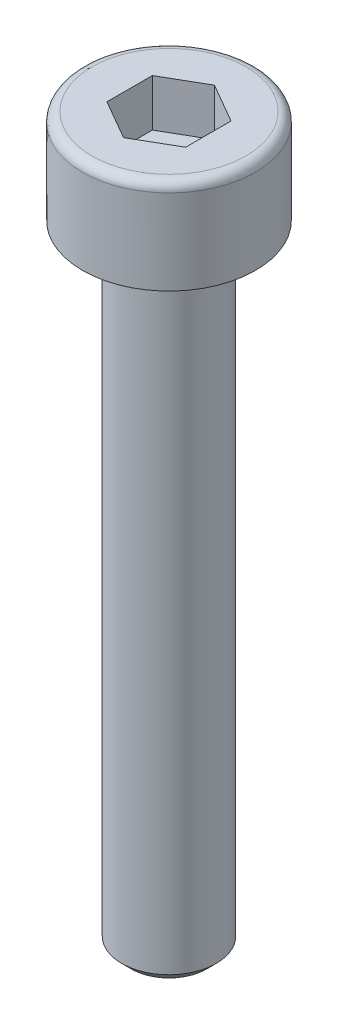
ISO-10303-21;
HEADER;
FILE_DESCRIPTION(('STEP AP214'),'2;1');
FILE_NAME('part.step','',(''),(''),'','','');
FILE_SCHEMA(('AUTOMOTIVE_DESIGN { 1 0 10303 214 1 1 1 1 }'));
ENDSEC;
DATA;
#1=APPLICATION_CONTEXT('core data for automotive mechanical design processes');
#2=APPLICATION_PROTOCOL_DEFINITION('international standard','automotive_design',2000,#1);
#3=PRODUCT_CONTEXT('',#1,'mechanical');
#4=PRODUCT('Part','Part','',(#3));
#5=PRODUCT_RELATED_PRODUCT_CATEGORY('part','',(#4));
#6=PRODUCT_DEFINITION_FORMATION('','',#4);
#7=PRODUCT_DEFINITION_CONTEXT('part definition',#1,'design');
#8=PRODUCT_DEFINITION('design','',#6,#7);
#9=PRODUCT_DEFINITION_SHAPE('','',#8);
#10=(LENGTH_UNIT() NAMED_UNIT(*) SI_UNIT(.MILLI.,.METRE.));
#11=(NAMED_UNIT(*) PLANE_ANGLE_UNIT() SI_UNIT($,.RADIAN.));
#12=(NAMED_UNIT(*) SI_UNIT($,.STERADIAN.) SOLID_ANGLE_UNIT());
#13=UNCERTAINTY_MEASURE_WITH_UNIT(LENGTH_MEASURE(1.E-05),#10,'distance_accuracy_value','');
#14=(GEOMETRIC_REPRESENTATION_CONTEXT(3) GLOBAL_UNCERTAINTY_ASSIGNED_CONTEXT((#13)) GLOBAL_UNIT_ASSIGNED_CONTEXT((#10,
#11,#12)) REPRESENTATION_CONTEXT('',''));
#15=CARTESIAN_POINT('',(0.,0.,0.));
#16=DIRECTION('',(0.,0.,1.));
#17=DIRECTION('',(1.,0.,0.));
#18=AXIS2_PLACEMENT_3D('',#15,#16,#17);
#19=CARTESIAN_POINT('',(-4.9,6.,4.9));
#20=DIRECTION('',(0.,1.,0.));
#21=DIRECTION('',(1.,0.,0.));
#22=AXIS2_PLACEMENT_3D('',#19,#20,#21);
#23=PLANE('',#22);
#24=CARTESIAN_POINT('',(0.,6.,0.));
#25=DIRECTION('',(0.,1.,0.));
#26=DIRECTION('',(0.,0.,-1.));
#27=AXIS2_PLACEMENT_3D('',#24,#25,#26);
#28=CIRCLE('',#27,4.9);
#29=CARTESIAN_POINT('',(0.,6.,-4.9));
#30=VERTEX_POINT('',#29);
#31=EDGE_CURVE('E89',#30,#30,#28,.F.);
#32=ORIENTED_EDGE('',*,*,#31,.F.);
#33=EDGE_LOOP('',(#32));
#34=FACE_BOUND('',#33,.T.);
#35=DIRECTION('',(-0.866025403784449,0.,0.499999999999983));
#36=VECTOR('',#35,1.);
#37=CARTESIAN_POINT('',(2.5,6.,1.4433756729741));
#38=LINE('',#37,#36);
#39=CARTESIAN_POINT('',(0.,6.,2.8867513459481));
#40=VERTEX_POINT('',#39);
#41=CARTESIAN_POINT('',(2.5,6.,1.4433756729741));
#42=VERTEX_POINT('',#41);
#43=EDGE_CURVE('E72',#40,#42,#38,.F.);
#44=ORIENTED_EDGE('',*,*,#43,.F.);
#45=DIRECTION('',(-0.866025403784449,0.,-0.499999999999983));
#46=VECTOR('',#45,1.);
#47=CARTESIAN_POINT('',(0.,6.,2.8867513459481));
#48=LINE('',#47,#46);
#49=CARTESIAN_POINT('',(-2.5,6.,1.4433756729741));
#50=VERTEX_POINT('',#49);
#51=EDGE_CURVE('E84',#50,#40,#48,.F.);
#52=ORIENTED_EDGE('',*,*,#51,.F.);
#53=DIRECTION('',(0.,0.,-1.));
#54=VECTOR('',#53,1.);
#55=CARTESIAN_POINT('',(-2.5,6.,1.4433756729741));
#56=LINE('',#55,#54);
#57=CARTESIAN_POINT('',(-2.5,6.,-1.4433756729741));
#58=VERTEX_POINT('',#57);
#59=EDGE_CURVE('E94',#58,#50,#56,.F.);
#60=ORIENTED_EDGE('',*,*,#59,.F.);
#61=DIRECTION('',(0.866025403784449,0.,-0.499999999999983));
#62=VECTOR('',#61,1.);
#63=CARTESIAN_POINT('',(-2.5,6.,-1.4433756729741));
#64=LINE('',#63,#62);
#65=CARTESIAN_POINT('',(0.,6.,-2.8867513459481));
#66=VERTEX_POINT('',#65);
#67=EDGE_CURVE('E96',#66,#58,#64,.F.);
#68=ORIENTED_EDGE('',*,*,#67,.F.);
#69=DIRECTION('',(0.866025403784449,0.,0.499999999999983));
#70=VECTOR('',#69,1.);
#71=CARTESIAN_POINT('',(0.,6.,-2.8867513459481));
#72=LINE('',#71,#70);
#73=CARTESIAN_POINT('',(2.5,6.,-1.4433756729741));
#74=VERTEX_POINT('',#73);
#75=EDGE_CURVE('E106',#74,#66,#72,.F.);
#76=ORIENTED_EDGE('',*,*,#75,.F.);
#77=DIRECTION('',(0.,0.,1.));
#78=VECTOR('',#77,1.);
#79=CARTESIAN_POINT('',(2.5,6.,-1.4433756729741));
#80=LINE('',#79,#78);
#81=EDGE_CURVE('E88',#74,#42,#80,.T.);
#82=ORIENTED_EDGE('',*,*,#81,.T.);
#83=EDGE_LOOP('',(#44,#52,#60,#68,#76,#82));
#84=FACE_BOUND('',#83,.T.);
#85=ADVANCED_FACE('F16',(#34,#84),#23,.T.);
#86=CARTESIAN_POINT('',(-5.5,0.,-5.5));
#87=DIRECTION('',(0.,-1.,0.));
#88=DIRECTION('',(1.,0.,0.));
#89=AXIS2_PLACEMENT_3D('',#86,#87,#88);
#90=PLANE('',#89);
#91=CARTESIAN_POINT('',(0.,0.,0.));
#92=DIRECTION('',(0.,-1.,0.));
#93=DIRECTION('',(0.,0.,1.));
#94=AXIS2_PLACEMENT_3D('',#91,#92,#93);
#95=CIRCLE('',#94,5.5);
#96=CARTESIAN_POINT('',(0.,0.,5.5));
#97=VERTEX_POINT('',#96);
#98=EDGE_CURVE('E114',#97,#97,#95,.T.);
#99=ORIENTED_EDGE('',*,*,#98,.T.);
#100=EDGE_LOOP('',(#99));
#101=FACE_BOUND('',#100,.T.);
#102=CARTESIAN_POINT('',(0.,0.,0.));
#103=DIRECTION('',(0.,1.,0.));
#104=DIRECTION('',(0.,0.,-1.));
#105=AXIS2_PLACEMENT_3D('',#102,#103,#104);
#106=CIRCLE('',#105,3.);
#107=CARTESIAN_POINT('',(0.,0.,-3.));
#108=VERTEX_POINT('',#107);
#109=EDGE_CURVE('E119',#108,#108,#106,.F.);
#110=ORIENTED_EDGE('',*,*,#109,.F.);
#111=EDGE_LOOP('',(#110));
#112=FACE_BOUND('',#111,.T.);
#113=ADVANCED_FACE('F187',(#101,#112),#90,.T.);
#114=CARTESIAN_POINT('',(-2.3865,-40.,-2.3865));
#115=DIRECTION('',(0.,-1.,0.));
#116=DIRECTION('',(1.,0.,0.));
#117=AXIS2_PLACEMENT_3D('',#114,#115,#116);
#118=PLANE('',#117);
#119=CARTESIAN_POINT('',(0.,-40.,0.));
#120=DIRECTION('',(0.,-1.,0.));
#121=DIRECTION('',(0.,0.,1.));
#122=AXIS2_PLACEMENT_3D('',#119,#120,#121);
#123=CIRCLE('',#122,2.3865);
#124=CARTESIAN_POINT('',(0.,-40.,2.3865));
#125=VERTEX_POINT('',#124);
#126=EDGE_CURVE('E122',#125,#125,#123,.T.);
#127=ORIENTED_EDGE('',*,*,#126,.T.);
#128=EDGE_LOOP('',(#127));
#129=FACE_BOUND('',#128,.T.);
#130=ADVANCED_FACE('F193',(#129),#118,.T.);
#131=CARTESIAN_POINT('',(-2.5,3.,-1.4433756729741));
#132=DIRECTION('',(1.,0.,0.));
#133=DIRECTION('',(0.,1.,0.));
#134=AXIS2_PLACEMENT_3D('',#131,#132,#133);
#135=PLANE('',#134);
#136=ORIENTED_EDGE('',*,*,#59,.T.);
#137=DIRECTION('',(0.,-1.,0.));
#138=VECTOR('',#137,1.);
#139=CARTESIAN_POINT('',(-2.5,6.,1.4433756729741));
#140=LINE('',#139,#138);
#141=CARTESIAN_POINT('',(-2.5,3.,1.4433756729741));
#142=VERTEX_POINT('',#141);
#143=EDGE_CURVE('E93',#142,#50,#140,.F.);
#144=ORIENTED_EDGE('',*,*,#143,.F.);
#145=DIRECTION('',(0.,0.,-1.));
#146=VECTOR('',#145,1.);
#147=CARTESIAN_POINT('',(-2.5,3.,1.4433756729741));
#148=LINE('',#147,#146);
#149=CARTESIAN_POINT('',(-2.5,3.,-1.4433756729741));
#150=VERTEX_POINT('',#149);
#151=EDGE_CURVE('E126',#150,#142,#148,.F.);
#152=ORIENTED_EDGE('',*,*,#151,.F.);
#153=DIRECTION('',(0.,1.,0.));
#154=VECTOR('',#153,1.);
#155=CARTESIAN_POINT('',(-2.5,3.,-1.4433756729741));
#156=LINE('',#155,#154);
#157=EDGE_CURVE('E78',#150,#58,#156,.T.);
#158=ORIENTED_EDGE('',*,*,#157,.T.);
#159=EDGE_LOOP('',(#136,#144,#152,#158));
#160=FACE_BOUND('',#159,.T.);
#161=ADVANCED_FACE('F200',(#160),#135,.T.);
#162=CARTESIAN_POINT('',(-2.5,3.,1.4433756729741));
#163=DIRECTION('',(0.499999999999983,0.,-0.866025403784449));
#164=DIRECTION('',(0.,1.,0.));
#165=AXIS2_PLACEMENT_3D('',#162,#163,#164);
#166=PLANE('',#165);
#167=ORIENTED_EDGE('',*,*,#51,.T.);
#168=DIRECTION('',(0.,-1.,0.));
#169=VECTOR('',#168,1.);
#170=CARTESIAN_POINT('',(0.,6.,2.8867513459481));
#171=LINE('',#170,#169);
#172=CARTESIAN_POINT('',(0.,3.,2.8867513459481));
#173=VERTEX_POINT('',#172);
#174=EDGE_CURVE('E68',#173,#40,#171,.F.);
#175=ORIENTED_EDGE('',*,*,#174,.F.);
#176=DIRECTION('',(-0.866025403784449,0.,-0.499999999999983));
#177=VECTOR('',#176,1.);
#178=CARTESIAN_POINT('',(0.,3.,2.8867513459481));
#179=LINE('',#178,#177);
#180=EDGE_CURVE('E77',#142,#173,#179,.F.);
#181=ORIENTED_EDGE('',*,*,#180,.F.);
#182=ORIENTED_EDGE('',*,*,#143,.T.);
#183=EDGE_LOOP('',(#167,#175,#181,#182));
#184=FACE_BOUND('',#183,.T.);
#185=ADVANCED_FACE('F91',(#184),#166,.T.);
#186=CARTESIAN_POINT('',(0.,3.,2.8867513459481));
#187=DIRECTION('',(-0.499999999999983,0.,-0.866025403784449));
#188=DIRECTION('',(0.,1.,0.));
#189=AXIS2_PLACEMENT_3D('',#186,#187,#188);
#190=PLANE('',#189);
#191=ORIENTED_EDGE('',*,*,#43,.T.);
#192=DIRECTION('',(0.,-1.,0.));
#193=VECTOR('',#192,1.);
#194=CARTESIAN_POINT('',(2.5,6.,1.4433756729741));
#195=LINE('',#194,#193);
#196=CARTESIAN_POINT('',(2.5,3.,1.4433756729741));
#197=VERTEX_POINT('',#196);
#198=EDGE_CURVE('E139',#197,#42,#195,.F.);
#199=ORIENTED_EDGE('',*,*,#198,.F.);
#200=DIRECTION('',(-0.866025403784449,0.,0.499999999999983));
#201=VECTOR('',#200,1.);
#202=CARTESIAN_POINT('',(2.5,3.,1.4433756729741));
#203=LINE('',#202,#201);
#204=EDGE_CURVE('E73',#173,#197,#203,.F.);
#205=ORIENTED_EDGE('',*,*,#204,.F.);
#206=ORIENTED_EDGE('',*,*,#174,.T.);
#207=EDGE_LOOP('',(#191,#199,#205,#206));
#208=FACE_BOUND('',#207,.T.);
#209=ADVANCED_FACE('F70',(#208),#190,.T.);
#210=CARTESIAN_POINT('',(2.5,3.,1.4433756729741));
#211=DIRECTION('',(-1.,0.,0.));
#212=DIRECTION('',(0.,1.,0.));
#213=AXIS2_PLACEMENT_3D('',#210,#211,#212);
#214=PLANE('',#213);
#215=ORIENTED_EDGE('',*,*,#198,.T.);
#216=ORIENTED_EDGE('',*,*,#81,.F.);
#217=DIRECTION('',(0.,-1.,0.));
#218=VECTOR('',#217,1.);
#219=CARTESIAN_POINT('',(2.5,6.,-1.4433756729741));
#220=LINE('',#219,#218);
#221=CARTESIAN_POINT('',(2.5,3.,-1.4433756729741));
#222=VERTEX_POINT('',#221);
#223=EDGE_CURVE('E146',#222,#74,#220,.F.);
#224=ORIENTED_EDGE('',*,*,#223,.F.);
#225=DIRECTION('',(0.,0.,1.));
#226=VECTOR('',#225,1.);
#227=CARTESIAN_POINT('',(2.5,3.,-1.4433756729741));
#228=LINE('',#227,#226);
#229=EDGE_CURVE('E36',#197,#222,#228,.F.);
#230=ORIENTED_EDGE('',*,*,#229,.F.);
#231=EDGE_LOOP('',(#215,#216,#224,#230));
#232=FACE_BOUND('',#231,.T.);
#233=ADVANCED_FACE('F209',(#232),#214,.T.);
#234=CARTESIAN_POINT('',(2.5,3.,-1.4433756729741));
#235=DIRECTION('',(-0.499999999999983,0.,0.866025403784449));
#236=DIRECTION('',(0.,1.,0.));
#237=AXIS2_PLACEMENT_3D('',#234,#235,#236);
#238=PLANE('',#237);
#239=ORIENTED_EDGE('',*,*,#75,.T.);
#240=DIRECTION('',(0.,-1.,0.));
#241=VECTOR('',#240,1.);
#242=CARTESIAN_POINT('',(0.,6.,-2.8867513459481));
#243=LINE('',#242,#241);
#244=CARTESIAN_POINT('',(0.,3.,-2.8867513459481));
#245=VERTEX_POINT('',#244);
#246=EDGE_CURVE('E153',#245,#66,#243,.F.);
#247=ORIENTED_EDGE('',*,*,#246,.F.);
#248=DIRECTION('',(0.866025403784449,0.,0.499999999999983));
#249=VECTOR('',#248,1.);
#250=CARTESIAN_POINT('',(0.,3.,-2.8867513459481));
#251=LINE('',#250,#249);
#252=EDGE_CURVE('E31',#222,#245,#251,.F.);
#253=ORIENTED_EDGE('',*,*,#252,.F.);
#254=ORIENTED_EDGE('',*,*,#223,.T.);
#255=EDGE_LOOP('',(#239,#247,#253,#254));
#256=FACE_BOUND('',#255,.T.);
#257=ADVANCED_FACE('F212',(#256),#238,.T.);
#258=CARTESIAN_POINT('',(0.,3.,-2.8867513459481));
#259=DIRECTION('',(0.499999999999983,0.,0.866025403784449));
#260=DIRECTION('',(0.,1.,0.));
#261=AXIS2_PLACEMENT_3D('',#258,#259,#260);
#262=PLANE('',#261);
#263=ORIENTED_EDGE('',*,*,#67,.T.);
#264=ORIENTED_EDGE('',*,*,#157,.F.);
#265=DIRECTION('',(0.866025403784449,0.,-0.499999999999983));
#266=VECTOR('',#265,1.);
#267=CARTESIAN_POINT('',(-2.5,3.,-1.4433756729741));
#268=LINE('',#267,#266);
#269=EDGE_CURVE('E160',#245,#150,#268,.F.);
#270=ORIENTED_EDGE('',*,*,#269,.F.);
#271=ORIENTED_EDGE('',*,*,#246,.T.);
#272=EDGE_LOOP('',(#263,#264,#270,#271));
#273=FACE_BOUND('',#272,.T.);
#274=ADVANCED_FACE('F183',(#273),#262,.T.);
#275=CARTESIAN_POINT('',(-2.5,3.,-2.8867513459481));
#276=DIRECTION('',(0.,1.,0.));
#277=DIRECTION('',(0.,0.,1.));
#278=AXIS2_PLACEMENT_3D('',#275,#276,#277);
#279=PLANE('',#278);
#280=ORIENTED_EDGE('',*,*,#151,.T.);
#281=ORIENTED_EDGE('',*,*,#180,.T.);
#282=ORIENTED_EDGE('',*,*,#204,.T.);
#283=ORIENTED_EDGE('',*,*,#229,.T.);
#284=ORIENTED_EDGE('',*,*,#252,.T.);
#285=ORIENTED_EDGE('',*,*,#269,.T.);
#286=EDGE_LOOP('',(#280,#281,#282,#283,#284,#285));
#287=FACE_BOUND('',#286,.T.);
#288=ADVANCED_FACE('F172',(#287),#279,.T.);
#289=CARTESIAN_POINT('',(0.,5.3999999999999,0.));
#290=DIRECTION('',(0.,-1.,0.));
#291=DIRECTION('',(1.92322280663656E-10,0.,1.));
#292=AXIS2_PLACEMENT_3D('',#289,#290,#291);
#293=TOROIDAL_SURFACE('',#292,4.8999999999999,0.600000000000098);
#294=ORIENTED_EDGE('',*,*,#31,.T.);
#295=EDGE_LOOP('',(#294));
#296=FACE_BOUND('',#295,.T.);
#297=CARTESIAN_POINT('',(0.,5.3999999999999,0.));
#298=DIRECTION('',(0.,1.,0.));
#299=DIRECTION('',(0.,0.,-1.));
#300=AXIS2_PLACEMENT_3D('',#297,#298,#299);
#301=CIRCLE('',#300,5.5);
#302=CARTESIAN_POINT('',(0.,5.3999999999999,-5.5));
#303=VERTEX_POINT('',#302);
#304=EDGE_CURVE('E24',#303,#303,#301,.F.);
#305=ORIENTED_EDGE('',*,*,#304,.F.);
#306=EDGE_LOOP('',(#305));
#307=FACE_BOUND('',#306,.T.);
#308=ADVANCED_FACE('F170',(#296,#307),#293,.T.);
#309=CARTESIAN_POINT('',(0.,-40.,0.));
#310=DIRECTION('',(0.,-1.,0.));
#311=DIRECTION('',(1.92322280663656E-10,0.,1.));
#312=AXIS2_PLACEMENT_3D('',#309,#310,#311);
#313=CYLINDRICAL_SURFACE('',#312,5.5);
#314=ORIENTED_EDGE('',*,*,#98,.F.);
#315=EDGE_LOOP('',(#314));
#316=FACE_BOUND('',#315,.T.);
#317=ORIENTED_EDGE('',*,*,#304,.T.);
#318=EDGE_LOOP('',(#317));
#319=FACE_BOUND('',#318,.T.);
#320=ADVANCED_FACE('F168',(#316,#319),#313,.T.);
#321=CARTESIAN_POINT('',(0.,-40.,0.));
#322=DIRECTION('',(0.,-1.,0.));
#323=DIRECTION('',(0.,0.,1.));
#324=AXIS2_PLACEMENT_3D('',#321,#322,#323);
#325=CYLINDRICAL_SURFACE('',#324,3.);
#326=CARTESIAN_POINT('',(0.,-39.3865,0.));
#327=DIRECTION('',(0.,1.,0.));
#328=DIRECTION('',(0.,0.,-1.));
#329=AXIS2_PLACEMENT_3D('',#326,#327,#328);
#330=CIRCLE('',#329,3.);
#331=CARTESIAN_POINT('',(0.,-39.3865,-3.));
#332=VERTEX_POINT('',#331);
#333=EDGE_CURVE('E11',#332,#332,#330,.F.);
#334=ORIENTED_EDGE('',*,*,#333,.F.);
#335=EDGE_LOOP('',(#334));
#336=FACE_BOUND('',#335,.T.);
#337=ORIENTED_EDGE('',*,*,#109,.T.);
#338=EDGE_LOOP('',(#337));
#339=FACE_BOUND('',#338,.T.);
#340=ADVANCED_FACE('F180',(#336,#339),#325,.T.);
#341=CARTESIAN_POINT('',(0.,-39.3865,0.));
#342=DIRECTION('',(0.,1.,0.));
#343=DIRECTION('',(0.,0.,-1.));
#344=AXIS2_PLACEMENT_3D('',#341,#342,#343);
#345=CONICAL_SURFACE('',#344,3.,0.785398163397446);
#346=ORIENTED_EDGE('',*,*,#126,.F.);
#347=EDGE_LOOP('',(#346));
#348=FACE_BOUND('',#347,.T.);
#349=ORIENTED_EDGE('',*,*,#333,.T.);
#350=EDGE_LOOP('',(#349));
#351=FACE_BOUND('',#350,.T.);
#352=ADVANCED_FACE('F18',(#348,#351),#345,.T.);
#353=CLOSED_SHELL('',(#85,#113,#130,#161,#185,#209,#233,#257,#274,#288,#308,#320,#340,#352));
#354=MANIFOLD_SOLID_BREP('B1',#353);
#355=ADVANCED_BREP_SHAPE_REPRESENTATION('',(#18,#354),#14);
#356=SHAPE_DEFINITION_REPRESENTATION(#9,#355);
ENDSEC;
END-ISO-10303-21;
